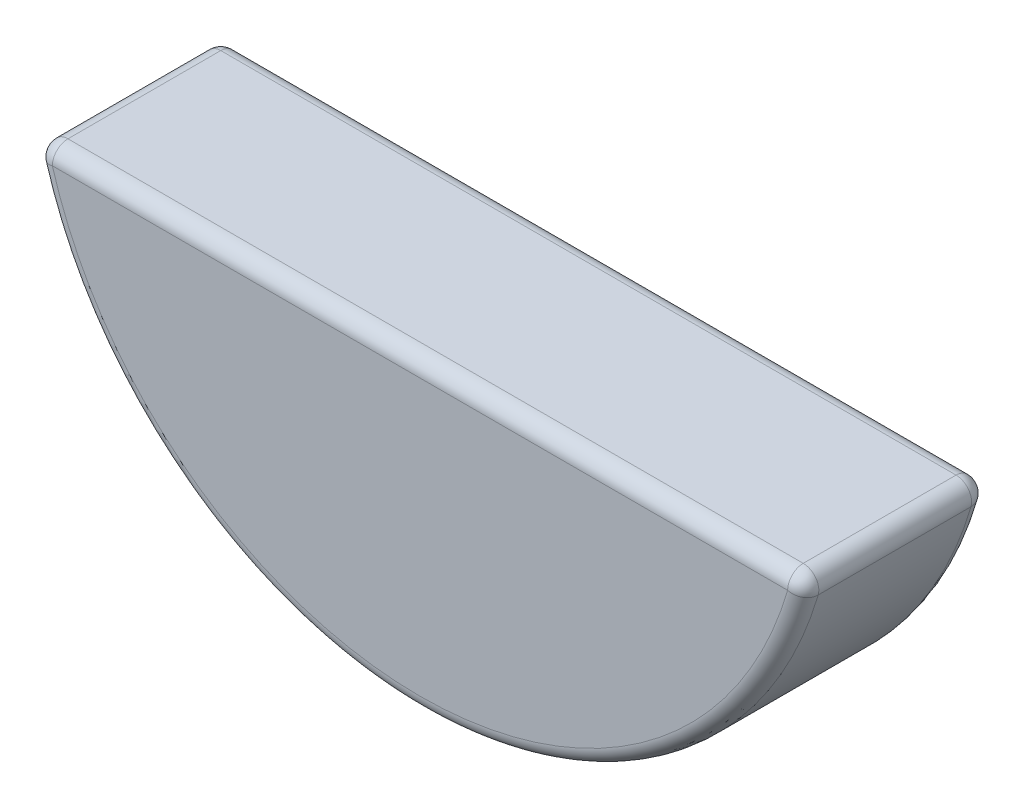
ISO-10303-21;
HEADER;
FILE_DESCRIPTION(('STEP AP214'),'2;1');
FILE_NAME('part.step','',(''),(''),'','','');
FILE_SCHEMA(('AUTOMOTIVE_DESIGN { 1 0 10303 214 1 1 1 1 }'));
ENDSEC;
DATA;
#1=APPLICATION_CONTEXT('core data for automotive mechanical design processes');
#2=APPLICATION_PROTOCOL_DEFINITION('international standard','automotive_design',2000,#1);
#3=PRODUCT_CONTEXT('',#1,'mechanical');
#4=PRODUCT('Part','Part','',(#3));
#5=PRODUCT_RELATED_PRODUCT_CATEGORY('part','',(#4));
#6=PRODUCT_DEFINITION_FORMATION('','',#4);
#7=PRODUCT_DEFINITION_CONTEXT('part definition',#1,'design');
#8=PRODUCT_DEFINITION('design','',#6,#7);
#9=PRODUCT_DEFINITION_SHAPE('','',#8);
#10=(LENGTH_UNIT() NAMED_UNIT(*) SI_UNIT(.MILLI.,.METRE.));
#11=(NAMED_UNIT(*) PLANE_ANGLE_UNIT() SI_UNIT($,.RADIAN.));
#12=(NAMED_UNIT(*) SI_UNIT($,.STERADIAN.) SOLID_ANGLE_UNIT());
#13=UNCERTAINTY_MEASURE_WITH_UNIT(LENGTH_MEASURE(1.E-05),#10,'distance_accuracy_value','');
#14=(GEOMETRIC_REPRESENTATION_CONTEXT(3) GLOBAL_UNCERTAINTY_ASSIGNED_CONTEXT((#13)) GLOBAL_UNIT_ASSIGNED_CONTEXT((#10,
#11,#12)) REPRESENTATION_CONTEXT('',''));
#15=CARTESIAN_POINT('',(0.,0.,0.));
#16=DIRECTION('',(0.,0.,1.));
#17=DIRECTION('',(1.,0.,0.));
#18=AXIS2_PLACEMENT_3D('',#15,#16,#17);
#19=CARTESIAN_POINT('',(0.,0.,1.5));
#20=DIRECTION('',(0.,0.,-1.));
#21=DIRECTION('',(-1.,0.,0.));
#22=AXIS2_PLACEMENT_3D('',#19,#20,#21);
#23=CYLINDRICAL_SURFACE('',#22,6.5);
#24=DIRECTION('',(0.,0.,-1.));
#25=VECTOR('',#24,1.);
#26=CARTESIAN_POINT('',(-6.23901441816396,-1.8233757401979,1.5));
#27=LINE('',#26,#25);
#28=CARTESIAN_POINT('',(-6.23901441816396,-1.8233757401979,1.246));
#29=VERTEX_POINT('',#28);
#30=CARTESIAN_POINT('',(-6.23901441816396,-1.8233757401979,-1.246));
#31=VERTEX_POINT('',#30);
#32=EDGE_CURVE('E120',#29,#31,#27,.T.);
#33=ORIENTED_EDGE('',*,*,#32,.T.);
#34=CARTESIAN_POINT('',(0.,0.,-1.246));
#35=DIRECTION('',(0.,0.,1.));
#36=DIRECTION('',(1.,0.,0.));
#37=AXIS2_PLACEMENT_3D('',#34,#35,#36);
#38=CIRCLE('',#37,6.5);
#39=CARTESIAN_POINT('',(6.23901441816396,-1.8233757401979,-1.246));
#40=VERTEX_POINT('',#39);
#41=EDGE_CURVE('E127',#31,#40,#38,.T.);
#42=ORIENTED_EDGE('',*,*,#41,.T.);
#43=DIRECTION('',(0.,0.,-1.));
#44=VECTOR('',#43,1.);
#45=CARTESIAN_POINT('',(6.23901441816396,-1.8233757401979,1.5));
#46=LINE('',#45,#44);
#47=CARTESIAN_POINT('',(6.23901441816396,-1.8233757401979,1.246));
#48=VERTEX_POINT('',#47);
#49=EDGE_CURVE('E95',#40,#48,#46,.F.);
#50=ORIENTED_EDGE('',*,*,#49,.T.);
#51=CARTESIAN_POINT('',(0.,0.,1.246));
#52=DIRECTION('',(0.,0.,1.));
#53=DIRECTION('',(1.,0.,0.));
#54=AXIS2_PLACEMENT_3D('',#51,#52,#53);
#55=CIRCLE('',#54,6.5);
#56=EDGE_CURVE('E118',#48,#29,#55,.F.);
#57=ORIENTED_EDGE('',*,*,#56,.T.);
#58=EDGE_LOOP('',(#33,#42,#50,#57));
#59=FACE_BOUND('',#58,.T.);
#60=ADVANCED_FACE('F34',(#59),#23,.T.);
#61=CARTESIAN_POINT('',(-6.325,-1.49812382665786,1.5));
#62=DIRECTION('',(0.,-1.,0.));
#63=DIRECTION('',(0.,0.,-1.));
#64=AXIS2_PLACEMENT_3D('',#61,#62,#63);
#65=PLANE('',#64);
#66=DIRECTION('',(-1.,0.,0.));
#67=VECTOR('',#66,1.);
#68=CARTESIAN_POINT('',(6.325,-1.49812382665786,1.246));
#69=LINE('',#68,#67);
#70=CARTESIAN_POINT('',(-5.99521293166955,-1.49812382665786,1.246));
#71=VERTEX_POINT('',#70);
#72=CARTESIAN_POINT('',(5.99521293166955,-1.49812382665786,1.246));
#73=VERTEX_POINT('',#72);
#74=EDGE_CURVE('E116',#71,#73,#69,.F.);
#75=ORIENTED_EDGE('',*,*,#74,.T.);
#76=DIRECTION('',(0.,0.,-1.));
#77=VECTOR('',#76,1.);
#78=CARTESIAN_POINT('',(5.99521293166955,-1.49812382665786,1.5));
#79=LINE('',#78,#77);
#80=CARTESIAN_POINT('',(5.99521293166955,-1.49812382665786,-1.246));
#81=VERTEX_POINT('',#80);
#82=EDGE_CURVE('E93',#73,#81,#79,.T.);
#83=ORIENTED_EDGE('',*,*,#82,.T.);
#84=DIRECTION('',(-1.,0.,0.));
#85=VECTOR('',#84,1.);
#86=CARTESIAN_POINT('',(-6.325,-1.49812382665786,-1.246));
#87=LINE('',#86,#85);
#88=CARTESIAN_POINT('',(-5.99521293166955,-1.49812382665786,-1.246));
#89=VERTEX_POINT('',#88);
#90=EDGE_CURVE('E106',#81,#89,#87,.T.);
#91=ORIENTED_EDGE('',*,*,#90,.T.);
#92=DIRECTION('',(0.,0.,-1.));
#93=VECTOR('',#92,1.);
#94=CARTESIAN_POINT('',(-5.99521293166955,-1.49812382665786,1.5));
#95=LINE('',#94,#93);
#96=EDGE_CURVE('E112',#89,#71,#95,.F.);
#97=ORIENTED_EDGE('',*,*,#96,.T.);
#98=EDGE_LOOP('',(#75,#83,#91,#97));
#99=FACE_BOUND('',#98,.T.);
#100=ADVANCED_FACE('F114',(#99),#65,.F.);
#101=CARTESIAN_POINT('',(0.,0.,1.5));
#102=DIRECTION('',(0.,0.,1.));
#103=DIRECTION('',(1.,0.,0.));
#104=AXIS2_PLACEMENT_3D('',#101,#102,#103);
#105=PLANE('',#104);
#106=CARTESIAN_POINT('',(0.,0.,1.5));
#107=DIRECTION('',(0.,0.,1.));
#108=DIRECTION('',(1.,0.,0.));
#109=AXIS2_PLACEMENT_3D('',#106,#107,#108);
#110=CIRCLE('',#109,6.246);
#111=CARTESIAN_POINT('',(-5.99521293166955,-1.75212382665786,1.5));
#112=VERTEX_POINT('',#111);
#113=CARTESIAN_POINT('',(5.99521293166955,-1.75212382665786,1.5));
#114=VERTEX_POINT('',#113);
#115=EDGE_CURVE('E129',#112,#114,#110,.T.);
#116=ORIENTED_EDGE('',*,*,#115,.T.);
#117=DIRECTION('',(-1.,0.,0.));
#118=VECTOR('',#117,1.);
#119=CARTESIAN_POINT('',(-6.325,-1.75212382665786,1.5));
#120=LINE('',#119,#118);
#121=EDGE_CURVE('E131',#114,#112,#120,.T.);
#122=ORIENTED_EDGE('',*,*,#121,.T.);
#123=EDGE_LOOP('',(#116,#122));
#124=FACE_BOUND('',#123,.T.);
#125=ADVANCED_FACE('F169',(#124),#105,.T.);
#126=CARTESIAN_POINT('',(0.,0.,-1.5));
#127=DIRECTION('',(0.,0.,1.));
#128=DIRECTION('',(1.,0.,0.));
#129=AXIS2_PLACEMENT_3D('',#126,#127,#128);
#130=PLANE('',#129);
#131=CARTESIAN_POINT('',(0.,0.,-1.5));
#132=DIRECTION('',(0.,0.,1.));
#133=DIRECTION('',(1.,0.,0.));
#134=AXIS2_PLACEMENT_3D('',#131,#132,#133);
#135=CIRCLE('',#134,6.246);
#136=CARTESIAN_POINT('',(5.99521293166955,-1.75212382665786,-1.5));
#137=VERTEX_POINT('',#136);
#138=CARTESIAN_POINT('',(-5.99521293166955,-1.75212382665786,-1.5));
#139=VERTEX_POINT('',#138);
#140=EDGE_CURVE('E43',#137,#139,#135,.F.);
#141=ORIENTED_EDGE('',*,*,#140,.T.);
#142=DIRECTION('',(-1.,0.,0.));
#143=VECTOR('',#142,1.);
#144=CARTESIAN_POINT('',(0.,-1.75212382665786,-1.5));
#145=LINE('',#144,#143);
#146=EDGE_CURVE('E11',#139,#137,#145,.F.);
#147=ORIENTED_EDGE('',*,*,#146,.T.);
#148=EDGE_LOOP('',(#141,#147));
#149=FACE_BOUND('',#148,.T.);
#150=ADVANCED_FACE('F260',(#149),#130,.F.);
#151=CARTESIAN_POINT('',(-5.99521293166955,-1.75212382665786,1.5));
#152=DIRECTION('',(0.,0.,-1.));
#153=DIRECTION('',(-1.,0.,0.));
#154=AXIS2_PLACEMENT_3D('',#151,#152,#153);
#155=CYLINDRICAL_SURFACE('',#154,0.254);
#156=CARTESIAN_POINT('',(-5.99521293166955,-1.75212382665786,1.246));
#157=DIRECTION('',(0.,0.,1.));
#158=DIRECTION('',(1.,0.,0.));
#159=AXIS2_PLACEMENT_3D('',#156,#157,#158);
#160=CIRCLE('',#159,0.254);
#161=EDGE_CURVE('E38',#71,#29,#160,.T.);
#162=ORIENTED_EDGE('',*,*,#161,.F.);
#163=ORIENTED_EDGE('',*,*,#96,.F.);
#164=CARTESIAN_POINT('',(-5.99521293166955,-1.75212382665786,-1.246));
#165=DIRECTION('',(0.,0.,-1.));
#166=DIRECTION('',(-1.,0.,0.));
#167=AXIS2_PLACEMENT_3D('',#164,#165,#166);
#168=CIRCLE('',#167,0.254);
#169=EDGE_CURVE('E150',#31,#89,#168,.T.);
#170=ORIENTED_EDGE('',*,*,#169,.F.);
#171=ORIENTED_EDGE('',*,*,#32,.F.);
#172=EDGE_LOOP('',(#162,#163,#170,#171));
#173=FACE_BOUND('',#172,.T.);
#174=ADVANCED_FACE('F36',(#173),#155,.T.);
#175=CARTESIAN_POINT('',(-5.99521293166955,-1.75212382665786,1.246));
#176=DIRECTION('',(0.,0.,1.));
#177=DIRECTION('',(1.,0.,0.));
#178=AXIS2_PLACEMENT_3D('',#175,#176,#177);
#179=SPHERICAL_SURFACE('',#178,0.254);
#180=CARTESIAN_POINT('',(-5.99521293166955,-1.75212382665786,1.246));
#181=DIRECTION('',(-1.,0.,0.));
#182=DIRECTION('',(0.,-1.,0.));
#183=AXIS2_PLACEMENT_3D('',#180,#181,#182);
#184=CIRCLE('',#183,0.254);
#185=EDGE_CURVE('E145',#71,#112,#184,.F.);
#186=ORIENTED_EDGE('',*,*,#185,.F.);
#187=ORIENTED_EDGE('',*,*,#161,.T.);
#188=CARTESIAN_POINT('',(-5.99521293166955,-1.75212382665786,1.246));
#189=DIRECTION('',(-0.280519344645831,0.959848372025224,0.));
#190=DIRECTION('',(-0.959848372025225,-0.280519344645831,0.));
#191=AXIS2_PLACEMENT_3D('',#188,#189,#190);
#192=CIRCLE('',#191,0.254);
#193=EDGE_CURVE('E148',#112,#29,#192,.F.);
#194=ORIENTED_EDGE('',*,*,#193,.F.);
#195=EDGE_LOOP('',(#186,#187,#194));
#196=FACE_BOUND('',#195,.T.);
#197=ADVANCED_FACE('F160',(#196),#179,.T.);
#198=CARTESIAN_POINT('',(-5.99521293166955,-1.75212382665786,-1.246));
#199=DIRECTION('',(0.,0.,1.));
#200=DIRECTION('',(1.,0.,0.));
#201=AXIS2_PLACEMENT_3D('',#198,#199,#200);
#202=SPHERICAL_SURFACE('',#201,0.254);
#203=CARTESIAN_POINT('',(-5.99521293166955,-1.75212382665786,-1.246));
#204=DIRECTION('',(-0.280519344645833,0.959848372025224,0.));
#205=DIRECTION('',(-0.959848372025224,-0.280519344645833,0.));
#206=AXIS2_PLACEMENT_3D('',#203,#204,#205);
#207=CIRCLE('',#206,0.254);
#208=EDGE_CURVE('E142',#31,#139,#207,.F.);
#209=ORIENTED_EDGE('',*,*,#208,.F.);
#210=ORIENTED_EDGE('',*,*,#169,.T.);
#211=CARTESIAN_POINT('',(-5.99521293166955,-1.75212382665786,-1.246));
#212=DIRECTION('',(-1.,0.,0.));
#213=DIRECTION('',(0.,0.,1.));
#214=AXIS2_PLACEMENT_3D('',#211,#212,#213);
#215=CIRCLE('',#214,0.254);
#216=EDGE_CURVE('E109',#139,#89,#215,.F.);
#217=ORIENTED_EDGE('',*,*,#216,.F.);
#218=EDGE_LOOP('',(#209,#210,#217));
#219=FACE_BOUND('',#218,.T.);
#220=ADVANCED_FACE('F236',(#219),#202,.T.);
#221=CARTESIAN_POINT('',(0.,0.,1.246));
#222=DIRECTION('',(0.,0.,1.));
#223=DIRECTION('',(1.,0.,0.));
#224=AXIS2_PLACEMENT_3D('',#221,#222,#223);
#225=TOROIDAL_SURFACE('',#224,6.246,0.254);
#226=ORIENTED_EDGE('',*,*,#193,.T.);
#227=ORIENTED_EDGE('',*,*,#56,.F.);
#228=CARTESIAN_POINT('',(5.99521293166955,-1.75212382665786,1.246));
#229=DIRECTION('',(0.280519344645833,0.959848372025224,0.));
#230=DIRECTION('',(-0.959848372025224,0.280519344645833,0.));
#231=AXIS2_PLACEMENT_3D('',#228,#229,#230);
#232=CIRCLE('',#231,0.254);
#233=EDGE_CURVE('E139',#114,#48,#232,.T.);
#234=ORIENTED_EDGE('',*,*,#233,.F.);
#235=ORIENTED_EDGE('',*,*,#115,.F.);
#236=EDGE_LOOP('',(#226,#227,#234,#235));
#237=FACE_BOUND('',#236,.T.);
#238=ADVANCED_FACE('F165',(#237),#225,.T.);
#239=CARTESIAN_POINT('',(0.,-1.75212382665786,1.246));
#240=DIRECTION('',(1.,0.,0.));
#241=DIRECTION('',(0.,0.,-1.));
#242=AXIS2_PLACEMENT_3D('',#239,#240,#241);
#243=CYLINDRICAL_SURFACE('',#242,0.254);
#244=ORIENTED_EDGE('',*,*,#185,.T.);
#245=ORIENTED_EDGE('',*,*,#121,.F.);
#246=CARTESIAN_POINT('',(5.99521293166955,-1.75212382665786,1.246));
#247=DIRECTION('',(1.,0.,0.));
#248=DIRECTION('',(0.,0.,-1.));
#249=AXIS2_PLACEMENT_3D('',#246,#247,#248);
#250=CIRCLE('',#249,0.254);
#251=EDGE_CURVE('E103',#73,#114,#250,.T.);
#252=ORIENTED_EDGE('',*,*,#251,.F.);
#253=ORIENTED_EDGE('',*,*,#74,.F.);
#254=EDGE_LOOP('',(#244,#245,#252,#253));
#255=FACE_BOUND('',#254,.T.);
#256=ADVANCED_FACE('F171',(#255),#243,.T.);
#257=CARTESIAN_POINT('',(-6.325,-1.75212382665786,-1.246));
#258=DIRECTION('',(-1.,0.,0.));
#259=DIRECTION('',(0.,0.,1.));
#260=AXIS2_PLACEMENT_3D('',#257,#258,#259);
#261=CYLINDRICAL_SURFACE('',#260,0.254);
#262=ORIENTED_EDGE('',*,*,#216,.T.);
#263=ORIENTED_EDGE('',*,*,#90,.F.);
#264=CARTESIAN_POINT('',(5.99521293166955,-1.75212382665786,-1.246));
#265=DIRECTION('',(1.,0.,0.));
#266=DIRECTION('',(0.,1.,0.));
#267=AXIS2_PLACEMENT_3D('',#264,#265,#266);
#268=CIRCLE('',#267,0.254);
#269=EDGE_CURVE('E98',#137,#81,#268,.T.);
#270=ORIENTED_EDGE('',*,*,#269,.F.);
#271=ORIENTED_EDGE('',*,*,#146,.F.);
#272=EDGE_LOOP('',(#262,#263,#270,#271));
#273=FACE_BOUND('',#272,.T.);
#274=ADVANCED_FACE('F107',(#273),#261,.T.);
#275=CARTESIAN_POINT('',(0.,0.,-1.246));
#276=DIRECTION('',(0.,0.,1.));
#277=DIRECTION('',(1.,0.,0.));
#278=AXIS2_PLACEMENT_3D('',#275,#276,#277);
#279=TOROIDAL_SURFACE('',#278,6.246,0.254);
#280=ORIENTED_EDGE('',*,*,#208,.T.);
#281=ORIENTED_EDGE('',*,*,#140,.F.);
#282=CARTESIAN_POINT('',(5.99521293166955,-1.75212382665786,-1.246));
#283=DIRECTION('',(0.280519344645831,0.959848372025224,0.));
#284=DIRECTION('',(-0.959848372025225,0.280519344645831,0.));
#285=AXIS2_PLACEMENT_3D('',#282,#283,#284);
#286=CIRCLE('',#285,0.254);
#287=EDGE_CURVE('E56',#40,#137,#286,.T.);
#288=ORIENTED_EDGE('',*,*,#287,.F.);
#289=ORIENTED_EDGE('',*,*,#41,.F.);
#290=EDGE_LOOP('',(#280,#281,#288,#289));
#291=FACE_BOUND('',#290,.T.);
#292=ADVANCED_FACE('F176',(#291),#279,.T.);
#293=CARTESIAN_POINT('',(5.99521293166955,-1.75212382665786,1.246));
#294=DIRECTION('',(0.,0.,1.));
#295=DIRECTION('',(1.,0.,0.));
#296=AXIS2_PLACEMENT_3D('',#293,#294,#295);
#297=SPHERICAL_SURFACE('',#296,0.254);
#298=ORIENTED_EDGE('',*,*,#251,.T.);
#299=ORIENTED_EDGE('',*,*,#233,.T.);
#300=CARTESIAN_POINT('',(5.99521293166955,-1.75212382665786,1.246));
#301=DIRECTION('',(0.,0.,1.));
#302=DIRECTION('',(1.,0.,0.));
#303=AXIS2_PLACEMENT_3D('',#300,#301,#302);
#304=CIRCLE('',#303,0.254);
#305=EDGE_CURVE('E96',#73,#48,#304,.F.);
#306=ORIENTED_EDGE('',*,*,#305,.F.);
#307=EDGE_LOOP('',(#298,#299,#306));
#308=FACE_BOUND('',#307,.T.);
#309=ADVANCED_FACE('F174',(#308),#297,.T.);
#310=CARTESIAN_POINT('',(5.99521293166955,-1.75212382665786,-1.246));
#311=DIRECTION('',(0.,0.,1.));
#312=DIRECTION('',(1.,0.,0.));
#313=AXIS2_PLACEMENT_3D('',#310,#311,#312);
#314=SPHERICAL_SURFACE('',#313,0.254);
#315=ORIENTED_EDGE('',*,*,#287,.T.);
#316=ORIENTED_EDGE('',*,*,#269,.T.);
#317=CARTESIAN_POINT('',(5.99521293166955,-1.75212382665786,-1.246));
#318=DIRECTION('',(0.,0.,-1.));
#319=DIRECTION('',(-1.,0.,0.));
#320=AXIS2_PLACEMENT_3D('',#317,#318,#319);
#321=CIRCLE('',#320,0.254);
#322=EDGE_CURVE('E90',#40,#81,#321,.F.);
#323=ORIENTED_EDGE('',*,*,#322,.F.);
#324=EDGE_LOOP('',(#315,#316,#323));
#325=FACE_BOUND('',#324,.T.);
#326=ADVANCED_FACE('F100',(#325),#314,.T.);
#327=CARTESIAN_POINT('',(5.99521293166955,-1.75212382665786,1.5));
#328=DIRECTION('',(0.,0.,-1.));
#329=DIRECTION('',(-1.,0.,0.));
#330=AXIS2_PLACEMENT_3D('',#327,#328,#329);
#331=CYLINDRICAL_SURFACE('',#330,0.254);
#332=ORIENTED_EDGE('',*,*,#305,.T.);
#333=ORIENTED_EDGE('',*,*,#49,.F.);
#334=ORIENTED_EDGE('',*,*,#322,.T.);
#335=ORIENTED_EDGE('',*,*,#82,.F.);
#336=EDGE_LOOP('',(#332,#333,#334,#335));
#337=FACE_BOUND('',#336,.T.);
#338=ADVANCED_FACE('F91',(#337),#331,.T.);
#339=CLOSED_SHELL('',(#60,#100,#125,#150,#174,#197,#220,#238,#256,#274,#292,#309,#326,#338));
#340=MANIFOLD_SOLID_BREP('B2',#339);
#341=ADVANCED_BREP_SHAPE_REPRESENTATION('',(#18,#340),#14);
#342=SHAPE_DEFINITION_REPRESENTATION(#9,#341);
ENDSEC;
END-ISO-10303-21;
